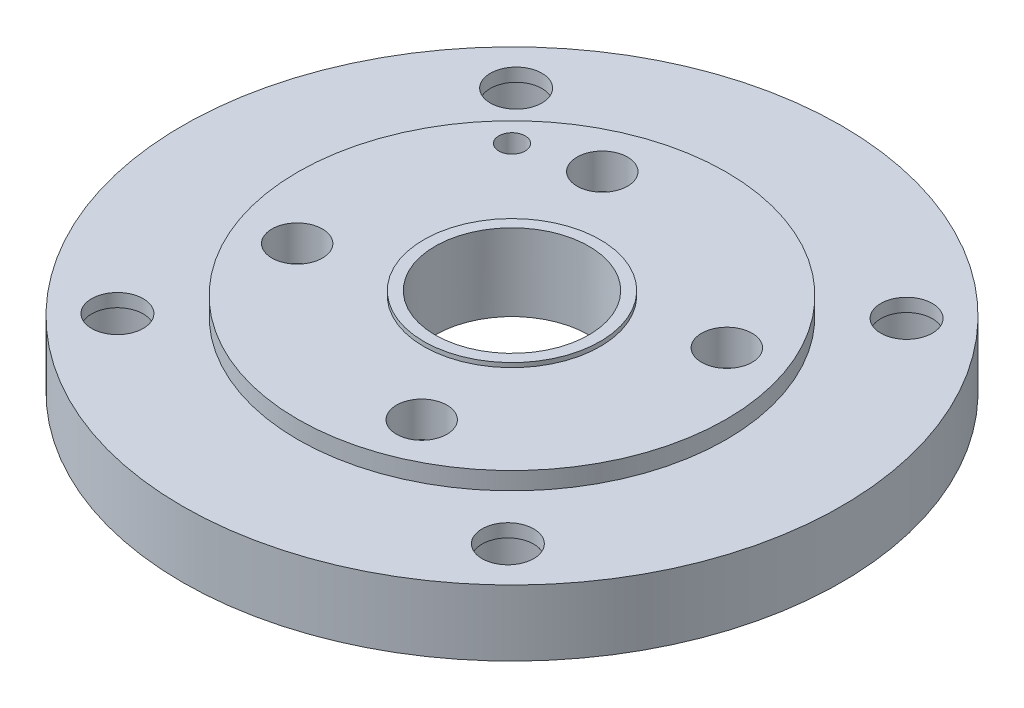
ISO-10303-21;
HEADER;
FILE_DESCRIPTION(('STEP AP214'),'2;1');
FILE_NAME('part.step','',(''),(''),'','','');
FILE_SCHEMA(('AUTOMOTIVE_DESIGN { 1 0 10303 214 1 1 1 1 }'));
ENDSEC;
DATA;
#1=APPLICATION_CONTEXT('core data for automotive mechanical design processes');
#2=APPLICATION_PROTOCOL_DEFINITION('international standard','automotive_design',2000,#1);
#3=PRODUCT_CONTEXT('',#1,'mechanical');
#4=PRODUCT('Part','Part','',(#3));
#5=PRODUCT_RELATED_PRODUCT_CATEGORY('part','',(#4));
#6=PRODUCT_DEFINITION_FORMATION('','',#4);
#7=PRODUCT_DEFINITION_CONTEXT('part definition',#1,'design');
#8=PRODUCT_DEFINITION('design','',#6,#7);
#9=PRODUCT_DEFINITION_SHAPE('','',#8);
#10=(LENGTH_UNIT() NAMED_UNIT(*) SI_UNIT(.MILLI.,.METRE.));
#11=(NAMED_UNIT(*) PLANE_ANGLE_UNIT() SI_UNIT($,.RADIAN.));
#12=(NAMED_UNIT(*) SI_UNIT($,.STERADIAN.) SOLID_ANGLE_UNIT());
#13=UNCERTAINTY_MEASURE_WITH_UNIT(LENGTH_MEASURE(1.E-05),#10,'distance_accuracy_value','');
#14=(GEOMETRIC_REPRESENTATION_CONTEXT(3) GLOBAL_UNCERTAINTY_ASSIGNED_CONTEXT((#13)) GLOBAL_UNIT_ASSIGNED_CONTEXT((#10,
#11,#12)) REPRESENTATION_CONTEXT('',''));
#15=CARTESIAN_POINT('',(0.,0.,0.));
#16=DIRECTION('',(0.,0.,1.));
#17=DIRECTION('',(1.,0.,0.));
#18=AXIS2_PLACEMENT_3D('',#15,#16,#17);
#19=CARTESIAN_POINT('',(-88.8572442451976,0.,-90.7380303133659));
#20=DIRECTION('',(0.,1.,0.));
#21=DIRECTION('',(0.,0.,1.));
#22=AXIS2_PLACEMENT_3D('',#19,#20,#21);
#23=CYLINDRICAL_SURFACE('',#22,11.75);
#24=CARTESIAN_POINT('',(-88.8572442451976,30.,-90.7380303133659));
#25=DIRECTION('',(0.,1.,0.));
#26=DIRECTION('',(0.,0.,1.));
#27=AXIS2_PLACEMENT_3D('',#24,#25,#26);
#28=CIRCLE('',#27,11.75);
#29=CARTESIAN_POINT('',(-88.8572442451976,30.,-78.9880303133659));
#30=VERTEX_POINT('',#29);
#31=EDGE_CURVE('E92',#30,#30,#28,.T.);
#32=ORIENTED_EDGE('',*,*,#31,.T.);
#33=EDGE_LOOP('',(#32));
#34=FACE_BOUND('',#33,.T.);
#35=CARTESIAN_POINT('',(-88.8572442451976,24.,-90.7380303133659));
#36=DIRECTION('',(0.,-1.,0.));
#37=DIRECTION('',(0.,0.,-1.));
#38=AXIS2_PLACEMENT_3D('',#35,#36,#37);
#39=CIRCLE('',#38,11.75);
#40=CARTESIAN_POINT('',(-88.8572442451976,24.,-102.488030313366));
#41=VERTEX_POINT('',#40);
#42=EDGE_CURVE('E35',#41,#41,#39,.F.);
#43=ORIENTED_EDGE('',*,*,#42,.F.);
#44=EDGE_LOOP('',(#43));
#45=FACE_BOUND('',#44,.T.);
#46=ADVANCED_FACE('F31',(#34,#45),#23,.F.);
#47=CARTESIAN_POINT('',(90.7380303133659,0.,-88.8572442451976));
#48=DIRECTION('',(0.,1.,0.));
#49=DIRECTION('',(0.,0.,1.));
#50=AXIS2_PLACEMENT_3D('',#47,#48,#49);
#51=CYLINDRICAL_SURFACE('',#50,11.7500000000004);
#52=CARTESIAN_POINT('',(90.7380303133659,30.,-88.8572442451976));
#53=DIRECTION('',(0.,1.,0.));
#54=DIRECTION('',(0.,0.,1.));
#55=AXIS2_PLACEMENT_3D('',#52,#53,#54);
#56=CIRCLE('',#55,11.7500000000004);
#57=CARTESIAN_POINT('',(90.7380303133659,30.,-77.1072442451972));
#58=VERTEX_POINT('',#57);
#59=EDGE_CURVE('E89',#58,#58,#56,.T.);
#60=ORIENTED_EDGE('',*,*,#59,.T.);
#61=EDGE_LOOP('',(#60));
#62=FACE_BOUND('',#61,.T.);
#63=CARTESIAN_POINT('',(90.7380303133659,24.,-88.8572442451976));
#64=DIRECTION('',(0.,-1.,0.));
#65=DIRECTION('',(0.,0.,-1.));
#66=AXIS2_PLACEMENT_3D('',#63,#64,#65);
#67=CIRCLE('',#66,11.7500000000004);
#68=CARTESIAN_POINT('',(90.7380303133659,24.,-100.607244245198));
#69=VERTEX_POINT('',#68);
#70=EDGE_CURVE('E69',#69,#69,#67,.F.);
#71=ORIENTED_EDGE('',*,*,#70,.F.);
#72=EDGE_LOOP('',(#71));
#73=FACE_BOUND('',#72,.T.);
#74=ADVANCED_FACE('F151',(#62,#73),#51,.F.);
#75=CARTESIAN_POINT('',(88.8572442451976,0.,90.7380303133659));
#76=DIRECTION('',(0.,1.,0.));
#77=DIRECTION('',(0.,0.,1.));
#78=AXIS2_PLACEMENT_3D('',#75,#76,#77);
#79=CYLINDRICAL_SURFACE('',#78,11.7500000000008);
#80=CARTESIAN_POINT('',(88.8572442451976,30.,90.7380303133659));
#81=DIRECTION('',(0.,1.,0.));
#82=DIRECTION('',(0.,0.,1.));
#83=AXIS2_PLACEMENT_3D('',#80,#81,#82);
#84=CIRCLE('',#83,11.7500000000008);
#85=CARTESIAN_POINT('',(88.8572442451976,30.,102.488030313367));
#86=VERTEX_POINT('',#85);
#87=EDGE_CURVE('E83',#86,#86,#84,.T.);
#88=ORIENTED_EDGE('',*,*,#87,.T.);
#89=EDGE_LOOP('',(#88));
#90=FACE_BOUND('',#89,.T.);
#91=CARTESIAN_POINT('',(88.8572442451976,24.,90.7380303133659));
#92=DIRECTION('',(0.,-1.,0.));
#93=DIRECTION('',(0.,0.,-1.));
#94=AXIS2_PLACEMENT_3D('',#91,#92,#93);
#95=CIRCLE('',#94,11.7500000000008);
#96=CARTESIAN_POINT('',(88.8572442451976,24.,78.9880303133651));
#97=VERTEX_POINT('',#96);
#98=EDGE_CURVE('E66',#97,#97,#95,.F.);
#99=ORIENTED_EDGE('',*,*,#98,.F.);
#100=EDGE_LOOP('',(#99));
#101=FACE_BOUND('',#100,.T.);
#102=ADVANCED_FACE('F157',(#90,#101),#79,.F.);
#103=CARTESIAN_POINT('',(-90.7380303133659,0.,88.8572442451977));
#104=DIRECTION('',(0.,1.,0.));
#105=DIRECTION('',(0.,0.,1.));
#106=AXIS2_PLACEMENT_3D('',#103,#104,#105);
#107=CYLINDRICAL_SURFACE('',#106,11.7500000000013);
#108=CARTESIAN_POINT('',(-90.7380303133659,30.,88.8572442451977));
#109=DIRECTION('',(0.,1.,0.));
#110=DIRECTION('',(0.,0.,1.));
#111=AXIS2_PLACEMENT_3D('',#108,#109,#110);
#112=CIRCLE('',#111,11.7500000000013);
#113=CARTESIAN_POINT('',(-90.7380303133659,30.,100.607244245199));
#114=VERTEX_POINT('',#113);
#115=EDGE_CURVE('E78',#114,#114,#112,.T.);
#116=ORIENTED_EDGE('',*,*,#115,.T.);
#117=EDGE_LOOP('',(#116));
#118=FACE_BOUND('',#117,.T.);
#119=CARTESIAN_POINT('',(-90.7380303133659,24.,88.8572442451977));
#120=DIRECTION('',(0.,-1.,0.));
#121=DIRECTION('',(0.,0.,-1.));
#122=AXIS2_PLACEMENT_3D('',#119,#120,#121);
#123=CIRCLE('',#122,11.7500000000013);
#124=CARTESIAN_POINT('',(-90.7380303133659,24.,77.1072442451964));
#125=VERTEX_POINT('',#124);
#126=EDGE_CURVE('E63',#125,#125,#123,.F.);
#127=ORIENTED_EDGE('',*,*,#126,.F.);
#128=EDGE_LOOP('',(#127));
#129=FACE_BOUND('',#128,.T.);
#130=ADVANCED_FACE('F163',(#118,#129),#107,.F.);
#131=CARTESIAN_POINT('',(0.,0.,0.));
#132=DIRECTION('',(0.,1.,0.));
#133=DIRECTION('',(0.,0.,1.));
#134=AXIS2_PLACEMENT_3D('',#131,#132,#133);
#135=CYLINDRICAL_SURFACE('',#134,35.);
#136=CARTESIAN_POINT('',(0.,40.,0.));
#137=DIRECTION('',(0.,1.,0.));
#138=DIRECTION('',(0.,0.,1.));
#139=AXIS2_PLACEMENT_3D('',#136,#137,#138);
#140=CIRCLE('',#139,35.);
#141=CARTESIAN_POINT('',(0.,40.,35.));
#142=VERTEX_POINT('',#141);
#143=EDGE_CURVE('E61',#142,#142,#140,.T.);
#144=ORIENTED_EDGE('',*,*,#143,.T.);
#145=EDGE_LOOP('',(#144));
#146=FACE_BOUND('',#145,.T.);
#147=CARTESIAN_POINT('',(0.,5.,0.));
#148=DIRECTION('',(0.,-1.,0.));
#149=DIRECTION('',(0.,0.,-1.));
#150=AXIS2_PLACEMENT_3D('',#147,#148,#149);
#151=CIRCLE('',#150,35.);
#152=CARTESIAN_POINT('',(0.,5.,-35.));
#153=VERTEX_POINT('',#152);
#154=EDGE_CURVE('E58',#153,#153,#151,.F.);
#155=ORIENTED_EDGE('',*,*,#154,.F.);
#156=EDGE_LOOP('',(#155));
#157=FACE_BOUND('',#156,.T.);
#158=ADVANCED_FACE('F209',(#146,#157),#135,.F.);
#159=CARTESIAN_POINT('',(0.,30.,0.));
#160=DIRECTION('',(0.,-1.,0.));
#161=DIRECTION('',(0.,0.,-1.));
#162=AXIS2_PLACEMENT_3D('',#159,#160,#161);
#163=CYLINDRICAL_SURFACE('',#162,150.);
#164=CARTESIAN_POINT('',(0.,30.,0.));
#165=DIRECTION('',(0.,1.,0.));
#166=DIRECTION('',(0.,0.,1.));
#167=AXIS2_PLACEMENT_3D('',#164,#165,#166);
#168=CIRCLE('',#167,150.);
#169=CARTESIAN_POINT('',(0.,30.,150.));
#170=VERTEX_POINT('',#169);
#171=EDGE_CURVE('E44',#170,#170,#168,.T.);
#172=ORIENTED_EDGE('',*,*,#171,.F.);
#173=EDGE_LOOP('',(#172));
#174=FACE_BOUND('',#173,.T.);
#175=CARTESIAN_POINT('',(0.,0.,0.));
#176=DIRECTION('',(0.,1.,0.));
#177=DIRECTION('',(0.,0.,1.));
#178=AXIS2_PLACEMENT_3D('',#175,#176,#177);
#179=CIRCLE('',#178,150.);
#180=CARTESIAN_POINT('',(0.,0.,150.));
#181=VERTEX_POINT('',#180);
#182=EDGE_CURVE('E52',#181,#181,#179,.T.);
#183=ORIENTED_EDGE('',*,*,#182,.T.);
#184=EDGE_LOOP('',(#183));
#185=FACE_BOUND('',#184,.T.);
#186=ADVANCED_FACE('F33',(#174,#185),#163,.T.);
#187=CARTESIAN_POINT('',(0.,30.,0.));
#188=DIRECTION('',(0.,1.,0.));
#189=DIRECTION('',(0.,0.,1.));
#190=AXIS2_PLACEMENT_3D('',#187,#188,#189);
#191=PLANE('',#190);
#192=ORIENTED_EDGE('',*,*,#115,.F.);
#193=EDGE_LOOP('',(#192));
#194=FACE_BOUND('',#193,.T.);
#195=ORIENTED_EDGE('',*,*,#87,.F.);
#196=EDGE_LOOP('',(#195));
#197=FACE_BOUND('',#196,.T.);
#198=ORIENTED_EDGE('',*,*,#59,.F.);
#199=EDGE_LOOP('',(#198));
#200=FACE_BOUND('',#199,.T.);
#201=ORIENTED_EDGE('',*,*,#31,.F.);
#202=EDGE_LOOP('',(#201));
#203=FACE_BOUND('',#202,.T.);
#204=CARTESIAN_POINT('',(0.,30.,0.));
#205=DIRECTION('',(0.,1.,0.));
#206=DIRECTION('',(0.,0.,1.));
#207=AXIS2_PLACEMENT_3D('',#204,#205,#206);
#208=CIRCLE('',#207,97.5);
#209=CARTESIAN_POINT('',(0.,30.,97.5));
#210=VERTEX_POINT('',#209);
#211=EDGE_CURVE('E39',#210,#210,#208,.T.);
#212=ORIENTED_EDGE('',*,*,#211,.F.);
#213=EDGE_LOOP('',(#212));
#214=FACE_BOUND('',#213,.T.);
#215=ORIENTED_EDGE('',*,*,#171,.T.);
#216=EDGE_LOOP('',(#215));
#217=FACE_BOUND('',#216,.T.);
#218=ADVANCED_FACE('F215',(#194,#197,#200,#203,#214,#217),#191,.T.);
#219=CARTESIAN_POINT('',(0.,0.,0.));
#220=DIRECTION('',(0.,1.,0.));
#221=DIRECTION('',(0.,0.,1.));
#222=AXIS2_PLACEMENT_3D('',#219,#220,#221);
#223=PLANE('',#222);
#224=CARTESIAN_POINT('',(-88.8572442451976,0.,-90.7380303133659));
#225=DIRECTION('',(0.,-1.,0.));
#226=DIRECTION('',(0.,0.,-1.));
#227=AXIS2_PLACEMENT_3D('',#224,#225,#226);
#228=CIRCLE('',#227,17.5000000000047);
#229=CARTESIAN_POINT('',(-88.8572442451976,0.,-108.238030313371));
#230=VERTEX_POINT('',#229);
#231=EDGE_CURVE('E286',#230,#230,#228,.T.);
#232=ORIENTED_EDGE('',*,*,#231,.F.);
#233=EDGE_LOOP('',(#232));
#234=FACE_BOUND('',#233,.T.);
#235=CARTESIAN_POINT('',(90.738030313366,0.,-88.8572442451975));
#236=DIRECTION('',(0.,-1.,0.));
#237=DIRECTION('',(0.,0.,-1.));
#238=AXIS2_PLACEMENT_3D('',#235,#236,#237);
#239=CIRCLE('',#238,17.5000000000061);
#240=CARTESIAN_POINT('',(90.738030313366,0.,-106.357244245204));
#241=VERTEX_POINT('',#240);
#242=EDGE_CURVE('E280',#241,#241,#239,.T.);
#243=ORIENTED_EDGE('',*,*,#242,.F.);
#244=EDGE_LOOP('',(#243));
#245=FACE_BOUND('',#244,.T.);
#246=CARTESIAN_POINT('',(88.8572442451977,0.,90.738030313366));
#247=DIRECTION('',(0.,-1.,0.));
#248=DIRECTION('',(0.,0.,-1.));
#249=AXIS2_PLACEMENT_3D('',#246,#247,#248);
#250=CIRCLE('',#249,17.5000000000014);
#251=CARTESIAN_POINT('',(88.8572442451977,0.,73.2380303133646));
#252=VERTEX_POINT('',#251);
#253=EDGE_CURVE('E271',#252,#252,#250,.T.);
#254=ORIENTED_EDGE('',*,*,#253,.F.);
#255=EDGE_LOOP('',(#254));
#256=FACE_BOUND('',#255,.T.);
#257=CARTESIAN_POINT('',(-90.7380303133659,0.,88.8572442451977));
#258=DIRECTION('',(0.,-1.,0.));
#259=DIRECTION('',(0.,0.,-1.));
#260=AXIS2_PLACEMENT_3D('',#257,#258,#259);
#261=CIRCLE('',#260,17.5);
#262=CARTESIAN_POINT('',(-90.7380303133659,0.,71.3572442451976));
#263=VERTEX_POINT('',#262);
#264=EDGE_CURVE('E87',#263,#263,#261,.T.);
#265=ORIENTED_EDGE('',*,*,#264,.F.);
#266=EDGE_LOOP('',(#265));
#267=FACE_BOUND('',#266,.T.);
#268=CARTESIAN_POINT('',(-60.,0.,-59.9999999999999));
#269=DIRECTION('',(0.,1.,0.));
#270=DIRECTION('',(0.,0.,1.));
#271=AXIS2_PLACEMENT_3D('',#268,#269,#270);
#272=CIRCLE('',#271,6.);
#273=CARTESIAN_POINT('',(-60.,0.,-53.9999999999999));
#274=VERTEX_POINT('',#273);
#275=EDGE_CURVE('E74',#274,#274,#272,.T.);
#276=ORIENTED_EDGE('',*,*,#275,.T.);
#277=EDGE_LOOP('',(#276));
#278=FACE_BOUND('',#277,.T.);
#279=CARTESIAN_POINT('',(0.,0.,0.));
#280=DIRECTION('',(0.,-1.,0.));
#281=DIRECTION('',(0.,0.,-1.));
#282=AXIS2_PLACEMENT_3D('',#279,#280,#281);
#283=CIRCLE('',#282,43.5);
#284=CARTESIAN_POINT('',(0.,0.,-43.5));
#285=VERTEX_POINT('',#284);
#286=EDGE_CURVE('E122',#285,#285,#283,.T.);
#287=ORIENTED_EDGE('',*,*,#286,.F.);
#288=EDGE_LOOP('',(#287));
#289=FACE_BOUND('',#288,.T.);
#290=ORIENTED_EDGE('',*,*,#182,.F.);
#291=EDGE_LOOP('',(#290));
#292=FACE_BOUND('',#291,.T.);
#293=ADVANCED_FACE('F292',(#234,#245,#256,#267,#278,#289,#292),#223,.F.);
#294=CARTESIAN_POINT('',(0.,38.,0.));
#295=DIRECTION('',(0.,-1.,0.));
#296=DIRECTION('',(0.,0.,-1.));
#297=AXIS2_PLACEMENT_3D('',#294,#295,#296);
#298=CYLINDRICAL_SURFACE('',#297,97.5);
#299=CARTESIAN_POINT('',(0.,38.,0.));
#300=DIRECTION('',(0.,1.,0.));
#301=DIRECTION('',(0.,0.,1.));
#302=AXIS2_PLACEMENT_3D('',#299,#300,#301);
#303=CIRCLE('',#302,97.5);
#304=CARTESIAN_POINT('',(0.,38.,97.5));
#305=VERTEX_POINT('',#304);
#306=EDGE_CURVE('E50',#305,#305,#303,.T.);
#307=ORIENTED_EDGE('',*,*,#306,.F.);
#308=EDGE_LOOP('',(#307));
#309=FACE_BOUND('',#308,.T.);
#310=ORIENTED_EDGE('',*,*,#211,.T.);
#311=EDGE_LOOP('',(#310));
#312=FACE_BOUND('',#311,.T.);
#313=ADVANCED_FACE('F147',(#309,#312),#298,.T.);
#314=CARTESIAN_POINT('',(0.,38.,0.));
#315=DIRECTION('',(0.,1.,0.));
#316=DIRECTION('',(0.,0.,1.));
#317=AXIS2_PLACEMENT_3D('',#314,#315,#316);
#318=PLANE('',#317);
#319=CARTESIAN_POINT('',(-69.4402938607498,38.,28.3380590113844));
#320=DIRECTION('',(0.,1.,0.));
#321=DIRECTION('',(0.,0.,1.));
#322=AXIS2_PLACEMENT_3D('',#319,#320,#321);
#323=CIRCLE('',#322,11.5);
#324=CARTESIAN_POINT('',(-69.4402938607498,38.,39.8380590113844));
#325=VERTEX_POINT('',#324);
#326=EDGE_CURVE('E97',#325,#325,#323,.T.);
#327=ORIENTED_EDGE('',*,*,#326,.F.);
#328=EDGE_LOOP('',(#327));
#329=FACE_BOUND('',#328,.T.);
#330=CARTESIAN_POINT('',(28.3380590113846,38.,69.4402938607497));
#331=DIRECTION('',(0.,1.,0.));
#332=DIRECTION('',(0.,0.,1.));
#333=AXIS2_PLACEMENT_3D('',#330,#331,#332);
#334=CIRCLE('',#333,11.5);
#335=CARTESIAN_POINT('',(28.3380590113846,38.,80.9402938607497));
#336=VERTEX_POINT('',#335);
#337=EDGE_CURVE('E111',#336,#336,#334,.T.);
#338=ORIENTED_EDGE('',*,*,#337,.F.);
#339=EDGE_LOOP('',(#338));
#340=FACE_BOUND('',#339,.T.);
#341=CARTESIAN_POINT('',(69.4402938607496,38.,-28.3380590113849));
#342=DIRECTION('',(0.,1.,0.));
#343=DIRECTION('',(0.,0.,1.));
#344=AXIS2_PLACEMENT_3D('',#341,#342,#343);
#345=CIRCLE('',#344,11.5);
#346=CARTESIAN_POINT('',(69.4402938607496,38.,-16.8380590113849));
#347=VERTEX_POINT('',#346);
#348=EDGE_CURVE('E105',#347,#347,#345,.T.);
#349=ORIENTED_EDGE('',*,*,#348,.F.);
#350=EDGE_LOOP('',(#349));
#351=FACE_BOUND('',#350,.T.);
#352=CARTESIAN_POINT('',(-60.,38.,-59.9999999999999));
#353=DIRECTION('',(0.,1.,0.));
#354=DIRECTION('',(0.,0.,1.));
#355=AXIS2_PLACEMENT_3D('',#352,#353,#354);
#356=CIRCLE('',#355,6.);
#357=CARTESIAN_POINT('',(-60.,38.,-53.9999999999999));
#358=VERTEX_POINT('',#357);
#359=EDGE_CURVE('E98',#358,#358,#356,.T.);
#360=ORIENTED_EDGE('',*,*,#359,.F.);
#361=EDGE_LOOP('',(#360));
#362=FACE_BOUND('',#361,.T.);
#363=CARTESIAN_POINT('',(-28.3380590113851,38.,-69.4402938607495));
#364=DIRECTION('',(0.,1.,0.));
#365=DIRECTION('',(0.,0.,1.));
#366=AXIS2_PLACEMENT_3D('',#363,#364,#365);
#367=CIRCLE('',#366,11.5);
#368=CARTESIAN_POINT('',(-28.3380590113851,38.,-57.9402938607495));
#369=VERTEX_POINT('',#368);
#370=EDGE_CURVE('E101',#369,#369,#367,.T.);
#371=ORIENTED_EDGE('',*,*,#370,.F.);
#372=EDGE_LOOP('',(#371));
#373=FACE_BOUND('',#372,.T.);
#374=CARTESIAN_POINT('',(0.,38.,0.));
#375=DIRECTION('',(0.,1.,0.));
#376=DIRECTION('',(0.,0.,1.));
#377=AXIS2_PLACEMENT_3D('',#374,#375,#376);
#378=CIRCLE('',#377,40.15);
#379=CARTESIAN_POINT('',(0.,38.,40.15));
#380=VERTEX_POINT('',#379);
#381=EDGE_CURVE('E10',#380,#380,#378,.T.);
#382=ORIENTED_EDGE('',*,*,#381,.F.);
#383=EDGE_LOOP('',(#382));
#384=FACE_BOUND('',#383,.T.);
#385=ORIENTED_EDGE('',*,*,#306,.T.);
#386=EDGE_LOOP('',(#385));
#387=FACE_BOUND('',#386,.T.);
#388=ADVANCED_FACE('F138',(#329,#340,#351,#362,#373,#384,#387),#318,.T.);
#389=CARTESIAN_POINT('',(0.,40.,0.));
#390=DIRECTION('',(0.,-1.,0.));
#391=DIRECTION('',(0.,0.,-1.));
#392=AXIS2_PLACEMENT_3D('',#389,#390,#391);
#393=CYLINDRICAL_SURFACE('',#392,40.15);
#394=CARTESIAN_POINT('',(0.,40.,0.));
#395=DIRECTION('',(0.,1.,0.));
#396=DIRECTION('',(0.,0.,1.));
#397=AXIS2_PLACEMENT_3D('',#394,#395,#396);
#398=CIRCLE('',#397,40.15);
#399=CARTESIAN_POINT('',(0.,40.,40.15));
#400=VERTEX_POINT('',#399);
#401=EDGE_CURVE('E48',#400,#400,#398,.T.);
#402=ORIENTED_EDGE('',*,*,#401,.F.);
#403=EDGE_LOOP('',(#402));
#404=FACE_BOUND('',#403,.T.);
#405=ORIENTED_EDGE('',*,*,#381,.T.);
#406=EDGE_LOOP('',(#405));
#407=FACE_BOUND('',#406,.T.);
#408=ADVANCED_FACE('F136',(#404,#407),#393,.T.);
#409=CARTESIAN_POINT('',(0.,40.,0.));
#410=DIRECTION('',(0.,1.,0.));
#411=DIRECTION('',(0.,0.,1.));
#412=AXIS2_PLACEMENT_3D('',#409,#410,#411);
#413=PLANE('',#412);
#414=ORIENTED_EDGE('',*,*,#143,.F.);
#415=EDGE_LOOP('',(#414));
#416=FACE_BOUND('',#415,.T.);
#417=ORIENTED_EDGE('',*,*,#401,.T.);
#418=EDGE_LOOP('',(#417));
#419=FACE_BOUND('',#418,.T.);
#420=ADVANCED_FACE('F134',(#416,#419),#413,.T.);
#421=CARTESIAN_POINT('',(0.,5.,0.));
#422=DIRECTION('',(0.,-1.,0.));
#423=DIRECTION('',(0.,0.,-1.));
#424=AXIS2_PLACEMENT_3D('',#421,#422,#423);
#425=PLANE('',#424);
#426=CARTESIAN_POINT('',(0.,5.,0.));
#427=DIRECTION('',(0.,-1.,0.));
#428=DIRECTION('',(0.,0.,-1.));
#429=AXIS2_PLACEMENT_3D('',#426,#427,#428);
#430=CIRCLE('',#429,43.5);
#431=CARTESIAN_POINT('',(0.,5.,-43.5));
#432=VERTEX_POINT('',#431);
#433=EDGE_CURVE('E62',#432,#432,#430,.T.);
#434=ORIENTED_EDGE('',*,*,#433,.T.);
#435=EDGE_LOOP('',(#434));
#436=FACE_BOUND('',#435,.T.);
#437=ORIENTED_EDGE('',*,*,#154,.T.);
#438=EDGE_LOOP('',(#437));
#439=FACE_BOUND('',#438,.T.);
#440=ADVANCED_FACE('F144',(#436,#439),#425,.T.);
#441=CARTESIAN_POINT('',(0.,5.,0.));
#442=DIRECTION('',(0.,-1.,0.));
#443=DIRECTION('',(0.,0.,-1.));
#444=AXIS2_PLACEMENT_3D('',#441,#442,#443);
#445=CYLINDRICAL_SURFACE('',#444,43.5);
#446=ORIENTED_EDGE('',*,*,#433,.F.);
#447=EDGE_LOOP('',(#446));
#448=FACE_BOUND('',#447,.T.);
#449=ORIENTED_EDGE('',*,*,#286,.T.);
#450=EDGE_LOOP('',(#449));
#451=FACE_BOUND('',#450,.T.);
#452=ADVANCED_FACE('F201',(#448,#451),#445,.F.);
#453=CARTESIAN_POINT('',(-28.3380590113851,22.,-69.4402938607495));
#454=DIRECTION('',(0.,1.,0.));
#455=DIRECTION('',(0.,0.,1.));
#456=AXIS2_PLACEMENT_3D('',#453,#454,#455);
#457=CYLINDRICAL_SURFACE('',#456,11.5);
#458=CARTESIAN_POINT('',(-28.3380590113851,22.,-69.4402938607495));
#459=DIRECTION('',(0.,1.,0.));
#460=DIRECTION('',(0.,0.,1.));
#461=AXIS2_PLACEMENT_3D('',#458,#459,#460);
#462=CIRCLE('',#461,11.5);
#463=CARTESIAN_POINT('',(-28.3380590113851,22.,-57.9402938607495));
#464=VERTEX_POINT('',#463);
#465=EDGE_CURVE('E119',#464,#464,#462,.T.);
#466=ORIENTED_EDGE('',*,*,#465,.F.);
#467=EDGE_LOOP('',(#466));
#468=FACE_BOUND('',#467,.T.);
#469=ORIENTED_EDGE('',*,*,#370,.T.);
#470=EDGE_LOOP('',(#469));
#471=FACE_BOUND('',#470,.T.);
#472=ADVANCED_FACE('F197',(#468,#471),#457,.F.);
#473=CARTESIAN_POINT('',(-28.3380590113851,22.,-69.4402938607495));
#474=DIRECTION('',(0.,1.,0.));
#475=DIRECTION('',(0.,0.,1.));
#476=AXIS2_PLACEMENT_3D('',#473,#474,#475);
#477=PLANE('',#476);
#478=ORIENTED_EDGE('',*,*,#465,.T.);
#479=EDGE_LOOP('',(#478));
#480=FACE_BOUND('',#479,.T.);
#481=ADVANCED_FACE('F169',(#480),#477,.T.);
#482=CARTESIAN_POINT('',(-60.,22.,-59.9999999999999));
#483=DIRECTION('',(0.,1.,0.));
#484=DIRECTION('',(0.,0.,1.));
#485=AXIS2_PLACEMENT_3D('',#482,#483,#484);
#486=CYLINDRICAL_SURFACE('',#485,6.);
#487=ORIENTED_EDGE('',*,*,#359,.T.);
#488=EDGE_LOOP('',(#487));
#489=FACE_BOUND('',#488,.T.);
#490=ORIENTED_EDGE('',*,*,#275,.F.);
#491=EDGE_LOOP('',(#490));
#492=FACE_BOUND('',#491,.T.);
#493=ADVANCED_FACE('F165',(#489,#492),#486,.F.);
#494=CARTESIAN_POINT('',(69.4402938607496,22.,-28.3380590113849));
#495=DIRECTION('',(0.,1.,0.));
#496=DIRECTION('',(0.,0.,1.));
#497=AXIS2_PLACEMENT_3D('',#494,#495,#496);
#498=CYLINDRICAL_SURFACE('',#497,11.5);
#499=CARTESIAN_POINT('',(69.4402938607496,22.,-28.3380590113849));
#500=DIRECTION('',(0.,1.,0.));
#501=DIRECTION('',(0.,0.,1.));
#502=AXIS2_PLACEMENT_3D('',#499,#500,#501);
#503=CIRCLE('',#502,11.5);
#504=CARTESIAN_POINT('',(69.4402938607496,22.,-16.8380590113849));
#505=VERTEX_POINT('',#504);
#506=EDGE_CURVE('E102',#505,#505,#503,.T.);
#507=ORIENTED_EDGE('',*,*,#506,.F.);
#508=EDGE_LOOP('',(#507));
#509=FACE_BOUND('',#508,.T.);
#510=ORIENTED_EDGE('',*,*,#348,.T.);
#511=EDGE_LOOP('',(#510));
#512=FACE_BOUND('',#511,.T.);
#513=ADVANCED_FACE('F168',(#509,#512),#498,.F.);
#514=CARTESIAN_POINT('',(69.4402938607496,22.,-28.3380590113849));
#515=DIRECTION('',(0.,1.,0.));
#516=DIRECTION('',(0.,0.,1.));
#517=AXIS2_PLACEMENT_3D('',#514,#515,#516);
#518=PLANE('',#517);
#519=ORIENTED_EDGE('',*,*,#506,.T.);
#520=EDGE_LOOP('',(#519));
#521=FACE_BOUND('',#520,.T.);
#522=ADVANCED_FACE('F171',(#521),#518,.T.);
#523=CARTESIAN_POINT('',(28.3380590113846,22.,69.4402938607497));
#524=DIRECTION('',(0.,1.,0.));
#525=DIRECTION('',(0.,0.,1.));
#526=AXIS2_PLACEMENT_3D('',#523,#524,#525);
#527=CYLINDRICAL_SURFACE('',#526,11.5);
#528=CARTESIAN_POINT('',(28.3380590113846,22.,69.4402938607497));
#529=DIRECTION('',(0.,1.,0.));
#530=DIRECTION('',(0.,0.,1.));
#531=AXIS2_PLACEMENT_3D('',#528,#529,#530);
#532=CIRCLE('',#531,11.5);
#533=CARTESIAN_POINT('',(28.3380590113846,22.,80.9402938607497));
#534=VERTEX_POINT('',#533);
#535=EDGE_CURVE('E108',#534,#534,#532,.T.);
#536=ORIENTED_EDGE('',*,*,#535,.F.);
#537=EDGE_LOOP('',(#536));
#538=FACE_BOUND('',#537,.T.);
#539=ORIENTED_EDGE('',*,*,#337,.T.);
#540=EDGE_LOOP('',(#539));
#541=FACE_BOUND('',#540,.T.);
#542=ADVANCED_FACE('F174',(#538,#541),#527,.F.);
#543=CARTESIAN_POINT('',(28.3380590113846,22.,69.4402938607497));
#544=DIRECTION('',(0.,1.,0.));
#545=DIRECTION('',(0.,0.,1.));
#546=AXIS2_PLACEMENT_3D('',#543,#544,#545);
#547=PLANE('',#546);
#548=ORIENTED_EDGE('',*,*,#535,.T.);
#549=EDGE_LOOP('',(#548));
#550=FACE_BOUND('',#549,.T.);
#551=ADVANCED_FACE('F179',(#550),#547,.T.);
#552=CARTESIAN_POINT('',(-69.4402938607498,22.,28.3380590113844));
#553=DIRECTION('',(0.,1.,0.));
#554=DIRECTION('',(0.,0.,1.));
#555=AXIS2_PLACEMENT_3D('',#552,#553,#554);
#556=CYLINDRICAL_SURFACE('',#555,11.5);
#557=CARTESIAN_POINT('',(-69.4402938607498,22.,28.3380590113844));
#558=DIRECTION('',(0.,1.,0.));
#559=DIRECTION('',(0.,0.,1.));
#560=AXIS2_PLACEMENT_3D('',#557,#558,#559);
#561=CIRCLE('',#560,11.5);
#562=CARTESIAN_POINT('',(-69.4402938607498,22.,39.8380590113844));
#563=VERTEX_POINT('',#562);
#564=EDGE_CURVE('E114',#563,#563,#561,.T.);
#565=ORIENTED_EDGE('',*,*,#564,.F.);
#566=EDGE_LOOP('',(#565));
#567=FACE_BOUND('',#566,.T.);
#568=ORIENTED_EDGE('',*,*,#326,.T.);
#569=EDGE_LOOP('',(#568));
#570=FACE_BOUND('',#569,.T.);
#571=ADVANCED_FACE('F182',(#567,#570),#556,.F.);
#572=CARTESIAN_POINT('',(-69.4402938607498,22.,28.3380590113844));
#573=DIRECTION('',(0.,1.,0.));
#574=DIRECTION('',(0.,0.,1.));
#575=AXIS2_PLACEMENT_3D('',#572,#573,#574);
#576=PLANE('',#575);
#577=ORIENTED_EDGE('',*,*,#564,.T.);
#578=EDGE_LOOP('',(#577));
#579=FACE_BOUND('',#578,.T.);
#580=ADVANCED_FACE('F187',(#579),#576,.T.);
#581=CARTESIAN_POINT('',(-90.7380303133659,24.,88.8572442451977));
#582=DIRECTION('',(0.,-1.,0.));
#583=DIRECTION('',(0.,0.,-1.));
#584=AXIS2_PLACEMENT_3D('',#581,#582,#583);
#585=PLANE('',#584);
#586=CARTESIAN_POINT('',(-90.7380303133659,24.,88.8572442451977));
#587=DIRECTION('',(0.,-1.,0.));
#588=DIRECTION('',(0.,0.,-1.));
#589=AXIS2_PLACEMENT_3D('',#586,#587,#588);
#590=CIRCLE('',#589,17.5);
#591=CARTESIAN_POINT('',(-90.7380303133659,24.,71.3572442451976));
#592=VERTEX_POINT('',#591);
#593=EDGE_CURVE('E67',#592,#592,#590,.T.);
#594=ORIENTED_EDGE('',*,*,#593,.T.);
#595=EDGE_LOOP('',(#594));
#596=FACE_BOUND('',#595,.T.);
#597=ORIENTED_EDGE('',*,*,#126,.T.);
#598=EDGE_LOOP('',(#597));
#599=FACE_BOUND('',#598,.T.);
#600=ADVANCED_FACE('F190',(#596,#599),#585,.T.);
#601=CARTESIAN_POINT('',(-90.7380303133659,24.,88.8572442451977));
#602=DIRECTION('',(0.,-1.,0.));
#603=DIRECTION('',(0.,0.,-1.));
#604=AXIS2_PLACEMENT_3D('',#601,#602,#603);
#605=CYLINDRICAL_SURFACE('',#604,17.5);
#606=ORIENTED_EDGE('',*,*,#593,.F.);
#607=EDGE_LOOP('',(#606));
#608=FACE_BOUND('',#607,.T.);
#609=ORIENTED_EDGE('',*,*,#264,.T.);
#610=EDGE_LOOP('',(#609));
#611=FACE_BOUND('',#610,.T.);
#612=ADVANCED_FACE('F230',(#608,#611),#605,.F.);
#613=CARTESIAN_POINT('',(88.8572442451977,24.,90.738030313366));
#614=DIRECTION('',(0.,-1.,0.));
#615=DIRECTION('',(0.,0.,-1.));
#616=AXIS2_PLACEMENT_3D('',#613,#614,#615);
#617=PLANE('',#616);
#618=CARTESIAN_POINT('',(88.8572442451977,24.,90.738030313366));
#619=DIRECTION('',(0.,-1.,0.));
#620=DIRECTION('',(0.,0.,-1.));
#621=AXIS2_PLACEMENT_3D('',#618,#619,#620);
#622=CIRCLE('',#621,17.5000000000014);
#623=CARTESIAN_POINT('',(88.8572442451977,24.,73.2380303133646));
#624=VERTEX_POINT('',#623);
#625=EDGE_CURVE('E268',#624,#624,#622,.T.);
#626=ORIENTED_EDGE('',*,*,#625,.T.);
#627=EDGE_LOOP('',(#626));
#628=FACE_BOUND('',#627,.T.);
#629=ORIENTED_EDGE('',*,*,#98,.T.);
#630=EDGE_LOOP('',(#629));
#631=FACE_BOUND('',#630,.T.);
#632=ADVANCED_FACE('F236',(#628,#631),#617,.T.);
#633=CARTESIAN_POINT('',(88.8572442451977,24.,90.738030313366));
#634=DIRECTION('',(0.,-1.,0.));
#635=DIRECTION('',(0.,0.,-1.));
#636=AXIS2_PLACEMENT_3D('',#633,#634,#635);
#637=CYLINDRICAL_SURFACE('',#636,17.5000000000014);
#638=ORIENTED_EDGE('',*,*,#625,.F.);
#639=EDGE_LOOP('',(#638));
#640=FACE_BOUND('',#639,.T.);
#641=ORIENTED_EDGE('',*,*,#253,.T.);
#642=EDGE_LOOP('',(#641));
#643=FACE_BOUND('',#642,.T.);
#644=ADVANCED_FACE('F256',(#640,#643),#637,.F.);
#645=CARTESIAN_POINT('',(90.738030313366,24.,-88.8572442451975));
#646=DIRECTION('',(0.,-1.,0.));
#647=DIRECTION('',(0.,0.,-1.));
#648=AXIS2_PLACEMENT_3D('',#645,#646,#647);
#649=PLANE('',#648);
#650=CARTESIAN_POINT('',(90.738030313366,24.,-88.8572442451975));
#651=DIRECTION('',(0.,-1.,0.));
#652=DIRECTION('',(0.,0.,-1.));
#653=AXIS2_PLACEMENT_3D('',#650,#651,#652);
#654=CIRCLE('',#653,17.5000000000061);
#655=CARTESIAN_POINT('',(90.738030313366,24.,-106.357244245204));
#656=VERTEX_POINT('',#655);
#657=EDGE_CURVE('E275',#656,#656,#654,.T.);
#658=ORIENTED_EDGE('',*,*,#657,.T.);
#659=EDGE_LOOP('',(#658));
#660=FACE_BOUND('',#659,.T.);
#661=ORIENTED_EDGE('',*,*,#70,.T.);
#662=EDGE_LOOP('',(#661));
#663=FACE_BOUND('',#662,.T.);
#664=ADVANCED_FACE('F252',(#660,#663),#649,.T.);
#665=CARTESIAN_POINT('',(90.738030313366,24.,-88.8572442451975));
#666=DIRECTION('',(0.,-1.,0.));
#667=DIRECTION('',(0.,0.,-1.));
#668=AXIS2_PLACEMENT_3D('',#665,#666,#667);
#669=CYLINDRICAL_SURFACE('',#668,17.5000000000061);
#670=ORIENTED_EDGE('',*,*,#657,.F.);
#671=EDGE_LOOP('',(#670));
#672=FACE_BOUND('',#671,.T.);
#673=ORIENTED_EDGE('',*,*,#242,.T.);
#674=EDGE_LOOP('',(#673));
#675=FACE_BOUND('',#674,.T.);
#676=ADVANCED_FACE('F248',(#672,#675),#669,.F.);
#677=CARTESIAN_POINT('',(-88.8572442451976,24.,-90.7380303133659));
#678=DIRECTION('',(0.,-1.,0.));
#679=DIRECTION('',(0.,0.,-1.));
#680=AXIS2_PLACEMENT_3D('',#677,#678,#679);
#681=PLANE('',#680);
#682=CARTESIAN_POINT('',(-88.8572442451976,24.,-90.7380303133659));
#683=DIRECTION('',(0.,-1.,0.));
#684=DIRECTION('',(0.,0.,-1.));
#685=AXIS2_PLACEMENT_3D('',#682,#683,#684);
#686=CIRCLE('',#685,17.5000000000047);
#687=CARTESIAN_POINT('',(-88.8572442451976,24.,-108.238030313371));
#688=VERTEX_POINT('',#687);
#689=EDGE_CURVE('E283',#688,#688,#686,.T.);
#690=ORIENTED_EDGE('',*,*,#689,.T.);
#691=EDGE_LOOP('',(#690));
#692=FACE_BOUND('',#691,.T.);
#693=ORIENTED_EDGE('',*,*,#42,.T.);
#694=EDGE_LOOP('',(#693));
#695=FACE_BOUND('',#694,.T.);
#696=ADVANCED_FACE('F244',(#692,#695),#681,.T.);
#697=CARTESIAN_POINT('',(-88.8572442451976,24.,-90.7380303133659));
#698=DIRECTION('',(0.,-1.,0.));
#699=DIRECTION('',(0.,0.,-1.));
#700=AXIS2_PLACEMENT_3D('',#697,#698,#699);
#701=CYLINDRICAL_SURFACE('',#700,17.5000000000047);
#702=ORIENTED_EDGE('',*,*,#689,.F.);
#703=EDGE_LOOP('',(#702));
#704=FACE_BOUND('',#703,.T.);
#705=ORIENTED_EDGE('',*,*,#231,.T.);
#706=EDGE_LOOP('',(#705));
#707=FACE_BOUND('',#706,.T.);
#708=ADVANCED_FACE('F241',(#704,#707),#701,.F.);
#709=CLOSED_SHELL('',(#46,#74,#102,#130,#158,#186,#218,#293,#313,#388,#408,#420,#440,#452,#472,
#481,#493,#513,#522,#542,#551,#571,#580,#600,#612,#632,#644,#664,#676,#696,#708));
#710=MANIFOLD_SOLID_BREP('B2',#709);
#711=ADVANCED_BREP_SHAPE_REPRESENTATION('',(#18,#710),#14);
#712=SHAPE_DEFINITION_REPRESENTATION(#9,#711);
ENDSEC;
END-ISO-10303-21;
